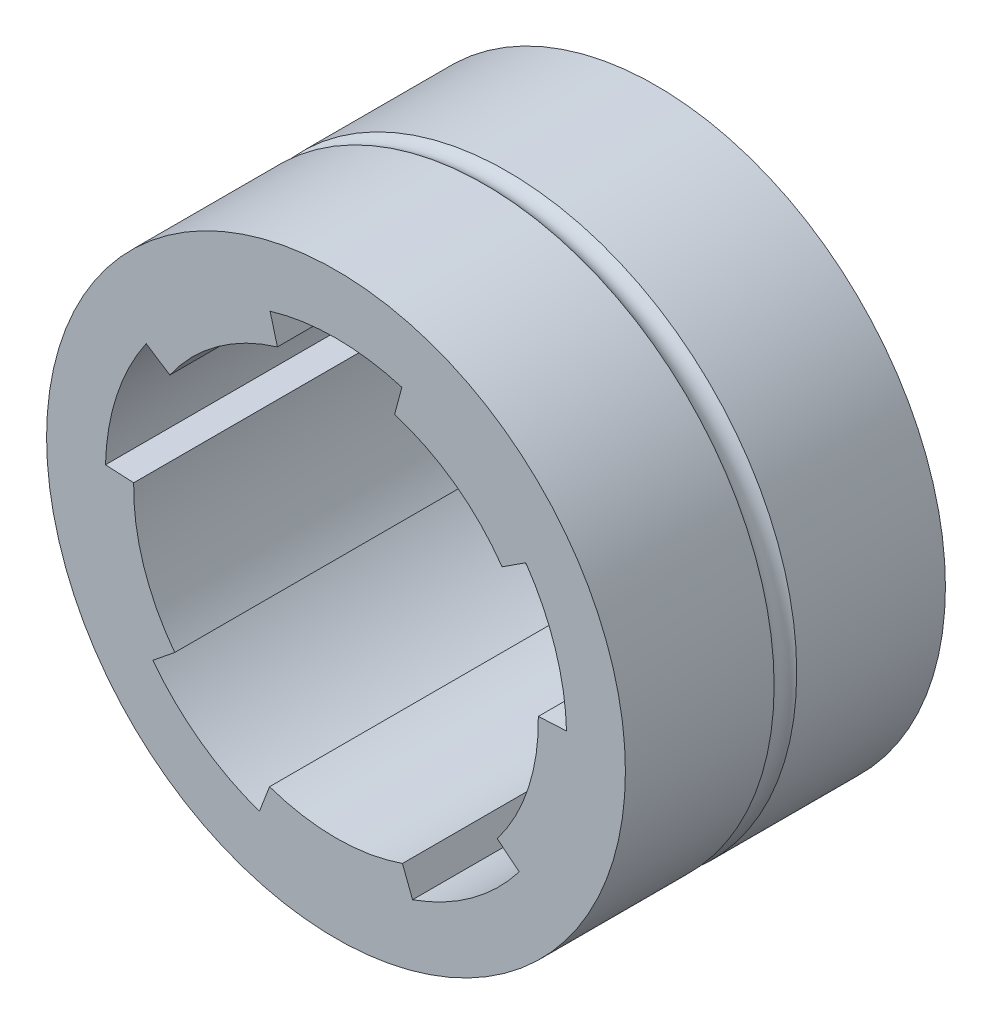
ISO-10303-21;
HEADER;
FILE_DESCRIPTION(('STEP AP214'),'2;1');
FILE_NAME('part.step','',(''),(''),'','','');
FILE_SCHEMA(('AUTOMOTIVE_DESIGN { 1 0 10303 214 1 1 1 1 }'));
ENDSEC;
DATA;
#1=APPLICATION_CONTEXT('core data for automotive mechanical design processes');
#2=APPLICATION_PROTOCOL_DEFINITION('international standard','automotive_design',2000,#1);
#3=PRODUCT_CONTEXT('',#1,'mechanical');
#4=PRODUCT('Part','Part','',(#3));
#5=PRODUCT_RELATED_PRODUCT_CATEGORY('part','',(#4));
#6=PRODUCT_DEFINITION_FORMATION('','',#4);
#7=PRODUCT_DEFINITION_CONTEXT('part definition',#1,'design');
#8=PRODUCT_DEFINITION('design','',#6,#7);
#9=PRODUCT_DEFINITION_SHAPE('','',#8);
#10=(LENGTH_UNIT() NAMED_UNIT(*) SI_UNIT(.MILLI.,.METRE.));
#11=(NAMED_UNIT(*) PLANE_ANGLE_UNIT() SI_UNIT($,.RADIAN.));
#12=(NAMED_UNIT(*) SI_UNIT($,.STERADIAN.) SOLID_ANGLE_UNIT());
#13=UNCERTAINTY_MEASURE_WITH_UNIT(LENGTH_MEASURE(1.E-05),#10,'distance_accuracy_value','');
#14=(GEOMETRIC_REPRESENTATION_CONTEXT(3) GLOBAL_UNCERTAINTY_ASSIGNED_CONTEXT((#13)) GLOBAL_UNIT_ASSIGNED_CONTEXT((#10,
#11,#12)) REPRESENTATION_CONTEXT('',''));
#15=CARTESIAN_POINT('',(0.,0.,0.));
#16=DIRECTION('',(0.,0.,1.));
#17=DIRECTION('',(1.,0.,0.));
#18=AXIS2_PLACEMENT_3D('',#15,#16,#17);
#19=CARTESIAN_POINT('',(0.,0.,-120.974134085945));
#20=DIRECTION('',(0.,0.,1.));
#21=DIRECTION('',(1.,0.,0.));
#22=AXIS2_PLACEMENT_3D('',#19,#20,#21);
#23=CYLINDRICAL_SURFACE('',#22,30.75);
#24=CARTESIAN_POINT('',(0.,0.,-15.8));
#25=DIRECTION('',(0.,0.,1.));
#26=DIRECTION('',(1.,0.,0.));
#27=AXIS2_PLACEMENT_3D('',#24,#25,#26);
#28=CIRCLE('',#27,30.75);
#29=CARTESIAN_POINT('',(30.75,0.,-15.8));
#30=VERTEX_POINT('',#29);
#31=EDGE_CURVE('E348',#30,#30,#28,.T.);
#32=ORIENTED_EDGE('',*,*,#31,.T.);
#33=EDGE_LOOP('',(#32));
#34=FACE_BOUND('',#33,.T.);
#35=CARTESIAN_POINT('',(0.,0.,0.));
#36=DIRECTION('',(0.,0.,1.));
#37=DIRECTION('',(1.,0.,0.));
#38=AXIS2_PLACEMENT_3D('',#35,#36,#37);
#39=CIRCLE('',#38,30.75);
#40=CARTESIAN_POINT('',(30.75,0.,0.));
#41=VERTEX_POINT('',#40);
#42=EDGE_CURVE('E277',#41,#41,#39,.T.);
#43=ORIENTED_EDGE('',*,*,#42,.F.);
#44=EDGE_LOOP('',(#43));
#45=FACE_BOUND('',#44,.T.);
#46=ADVANCED_FACE('F41',(#34,#45),#23,.T.);
#47=CARTESIAN_POINT('',(0.,0.,-18.2));
#48=DIRECTION('',(0.,0.,1.));
#49=DIRECTION('',(1.,0.,0.));
#50=AXIS2_PLACEMENT_3D('',#47,#48,#49);
#51=CIRCLE('',#50,30.75);
#52=CARTESIAN_POINT('',(30.75,0.,-18.2));
#53=VERTEX_POINT('',#52);
#54=EDGE_CURVE('E352',#53,#53,#51,.T.);
#55=ORIENTED_EDGE('',*,*,#54,.F.);
#56=EDGE_LOOP('',(#55));
#57=FACE_BOUND('',#56,.T.);
#58=CARTESIAN_POINT('',(0.,0.,-34.));
#59=DIRECTION('',(0.,0.,1.));
#60=DIRECTION('',(1.,0.,0.));
#61=AXIS2_PLACEMENT_3D('',#58,#59,#60);
#62=CIRCLE('',#61,30.75);
#63=CARTESIAN_POINT('',(30.75,0.,-34.));
#64=VERTEX_POINT('',#63);
#65=EDGE_CURVE('E11',#64,#64,#62,.F.);
#66=ORIENTED_EDGE('',*,*,#65,.F.);
#67=EDGE_LOOP('',(#66));
#68=FACE_BOUND('',#67,.T.);
#69=ADVANCED_FACE('F43',(#57,#68),#23,.T.);
#70=CARTESIAN_POINT('',(0.,0.,0.));
#71=DIRECTION('',(0.,0.,1.));
#72=DIRECTION('',(1.,0.,0.));
#73=AXIS2_PLACEMENT_3D('',#70,#71,#72);
#74=PLANE('',#73);
#75=CARTESIAN_POINT('',(0.,0.,0.));
#76=DIRECTION('',(0.,0.,1.));
#77=DIRECTION('',(1.,0.,0.));
#78=AXIS2_PLACEMENT_3D('',#75,#76,#77);
#79=CIRCLE('',#78,21.5);
#80=CARTESIAN_POINT('',(-6.22354286469245,20.579541156482,0.));
#81=VERTEX_POINT('',#80);
#82=CARTESIAN_POINT('',(-17.6491262088256,12.2783689496995,0.));
#83=VERTEX_POINT('',#82);
#84=EDGE_CURVE('E196',#81,#83,#79,.T.);
#85=ORIENTED_EDGE('',*,*,#84,.F.);
#86=DIRECTION('',(0.258819045102518,-0.965925826289069,0.));
#87=VECTOR('',#86,1.);
#88=CARTESIAN_POINT('',(-7.,23.4773186353492,0.));
#89=LINE('',#88,#87);
#90=CARTESIAN_POINT('',(-7.,23.4773186353492,0.));
#91=VERTEX_POINT('',#90);
#92=EDGE_CURVE('E270',#91,#81,#89,.T.);
#93=ORIENTED_EDGE('',*,*,#92,.F.);
#94=CARTESIAN_POINT('',(0.,0.,0.));
#95=DIRECTION('',(0.,0.,1.));
#96=DIRECTION('',(1.,0.,0.));
#97=AXIS2_PLACEMENT_3D('',#94,#95,#96);
#98=CIRCLE('',#97,24.4986630309842);
#99=CARTESIAN_POINT('',(7.,23.4773186353492,0.));
#100=VERTEX_POINT('',#99);
#101=EDGE_CURVE('E266',#100,#91,#98,.T.);
#102=ORIENTED_EDGE('',*,*,#101,.F.);
#103=DIRECTION('',(0.258819045102519,0.965925826289069,0.));
#104=VECTOR('',#103,1.);
#105=CARTESIAN_POINT('',(6.22354286469244,20.579541156482,0.));
#106=LINE('',#105,#104);
#107=CARTESIAN_POINT('',(6.22354286469244,20.579541156482,0.));
#108=VERTEX_POINT('',#107);
#109=EDGE_CURVE('E262',#108,#100,#106,.T.);
#110=ORIENTED_EDGE('',*,*,#109,.F.);
#111=CARTESIAN_POINT('',(0.,0.,0.));
#112=DIRECTION('',(0.,0.,1.));
#113=DIRECTION('',(1.,0.,0.));
#114=AXIS2_PLACEMENT_3D('',#111,#112,#113);
#115=CIRCLE('',#114,21.5);
#116=CARTESIAN_POINT('',(17.6491262088254,12.2783689496997,0.));
#117=VERTEX_POINT('',#116);
#118=EDGE_CURVE('E258',#117,#108,#115,.T.);
#119=ORIENTED_EDGE('',*,*,#118,.F.);
#120=DIRECTION('',(-0.83867056794542,-0.544639035015034,0.));
#121=VECTOR('',#120,1.);
#122=CARTESIAN_POINT('',(20.1651379126617,13.9122860547449,0.));
#123=LINE('',#122,#121);
#124=CARTESIAN_POINT('',(20.1651379126617,13.9122860547449,0.));
#125=VERTEX_POINT('',#124);
#126=EDGE_CURVE('E254',#125,#117,#123,.T.);
#127=ORIENTED_EDGE('',*,*,#126,.F.);
#128=CARTESIAN_POINT('',(0.,0.,0.));
#129=DIRECTION('',(0.,0.,1.));
#130=DIRECTION('',(1.,0.,0.));
#131=AXIS2_PLACEMENT_3D('',#128,#129,#130);
#132=CIRCLE('',#131,24.4986630309842);
#133=CARTESIAN_POINT('',(24.4913758339111,0.597494826612751,0.));
#134=VERTEX_POINT('',#133);
#135=EDGE_CURVE('E250',#134,#125,#132,.T.);
#136=ORIENTED_EDGE('',*,*,#135,.F.);
#137=DIRECTION('',(0.998629534754573,0.0523359562429588,0.));
#138=VECTOR('',#137,1.);
#139=CARTESIAN_POINT('',(21.4954872296474,0.440486957883874,0.));
#140=LINE('',#139,#138);
#141=CARTESIAN_POINT('',(21.4954872296474,0.440486957883874,0.));
#142=VERTEX_POINT('',#141);
#143=EDGE_CURVE('E246',#142,#134,#140,.T.);
#144=ORIENTED_EDGE('',*,*,#143,.F.);
#145=CARTESIAN_POINT('',(0.,0.,0.));
#146=DIRECTION('',(0.,0.,1.));
#147=DIRECTION('',(1.,0.,0.));
#148=AXIS2_PLACEMENT_3D('',#145,#146,#147);
#149=CIRCLE('',#148,21.5);
#150=CARTESIAN_POINT('',(17.1313027334833,-12.9910918191562,0.));
#151=VERTEX_POINT('',#150);
#152=EDGE_CURVE('E242',#151,#142,#149,.T.);
#153=ORIENTED_EDGE('',*,*,#152,.F.);
#154=DIRECTION('',(-0.777145961456976,0.629320391049832,0.));
#155=VECTOR('',#154,1.);
#156=CARTESIAN_POINT('',(19.4627406178543,-14.8790529923057,0.));
#157=LINE('',#156,#155);
#158=CARTESIAN_POINT('',(19.4627406178543,-14.8790529923057,0.));
#159=VERTEX_POINT('',#158);
#160=EDGE_CURVE('E238',#159,#151,#157,.T.);
#161=ORIENTED_EDGE('',*,*,#160,.F.);
#162=CARTESIAN_POINT('',(0.,0.,0.));
#163=DIRECTION('',(0.,0.,1.));
#164=DIRECTION('',(1.,0.,0.));
#165=AXIS2_PLACEMENT_3D('',#162,#163,#164);
#166=CIRCLE('',#165,24.4986630309843);
#167=CARTESIAN_POINT('',(8.13650269660507,-23.1080465244004,0.));
#168=VERTEX_POINT('',#167);
#169=EDGE_CURVE('E234',#168,#159,#166,.T.);
#170=ORIENTED_EDGE('',*,*,#169,.F.);
#171=DIRECTION('',(0.358367949545314,-0.933580426497197,0.));
#172=VECTOR('',#171,1.);
#173=CARTESIAN_POINT('',(7.06139884796913,-20.3073052449088,0.));
#174=LINE('',#173,#172);
#175=CARTESIAN_POINT('',(7.06139884796913,-20.3073052449088,0.));
#176=VERTEX_POINT('',#175);
#177=EDGE_CURVE('E230',#176,#168,#174,.T.);
#178=ORIENTED_EDGE('',*,*,#177,.F.);
#179=CARTESIAN_POINT('',(0.,0.,0.));
#180=DIRECTION('',(0.,0.,1.));
#181=DIRECTION('',(1.,0.,0.));
#182=AXIS2_PLACEMENT_3D('',#179,#180,#181);
#183=CIRCLE('',#182,21.5);
#184=CARTESIAN_POINT('',(-7.06139884796885,-20.3073052449089,0.));
#185=VERTEX_POINT('',#184);
#186=EDGE_CURVE('E226',#185,#176,#183,.T.);
#187=ORIENTED_EDGE('',*,*,#186,.F.);
#188=DIRECTION('',(0.3583679495453,0.933580426497202,0.));
#189=VECTOR('',#188,1.);
#190=CARTESIAN_POINT('',(-8.13650269660475,-23.1080465244005,0.));
#191=LINE('',#190,#189);
#192=CARTESIAN_POINT('',(-8.13650269660475,-23.1080465244005,0.));
#193=VERTEX_POINT('',#192);
#194=EDGE_CURVE('E222',#193,#185,#191,.T.);
#195=ORIENTED_EDGE('',*,*,#194,.F.);
#196=CARTESIAN_POINT('',(0.,0.,0.));
#197=DIRECTION('',(0.,0.,1.));
#198=DIRECTION('',(1.,0.,0.));
#199=AXIS2_PLACEMENT_3D('',#196,#197,#198);
#200=CIRCLE('',#199,24.4986630309842);
#201=CARTESIAN_POINT('',(-19.4627406178541,-14.8790529923059,0.));
#202=VERTEX_POINT('',#201);
#203=EDGE_CURVE('E218',#202,#193,#200,.T.);
#204=ORIENTED_EDGE('',*,*,#203,.F.);
#205=DIRECTION('',(-0.777145961456965,-0.629320391049845,0.));
#206=VECTOR('',#205,1.);
#207=CARTESIAN_POINT('',(-17.1313027334832,-12.9910918191564,0.));
#208=LINE('',#207,#206);
#209=CARTESIAN_POINT('',(-17.1313027334832,-12.9910918191564,0.));
#210=VERTEX_POINT('',#209);
#211=EDGE_CURVE('E214',#210,#202,#208,.T.);
#212=ORIENTED_EDGE('',*,*,#211,.F.);
#213=CARTESIAN_POINT('',(0.,0.,0.));
#214=DIRECTION('',(0.,0.,1.));
#215=DIRECTION('',(1.,0.,0.));
#216=AXIS2_PLACEMENT_3D('',#213,#214,#215);
#217=CIRCLE('',#216,21.5);
#218=CARTESIAN_POINT('',(-21.4954872296474,0.440486957883572,0.));
#219=VERTEX_POINT('',#218);
#220=EDGE_CURVE('E207',#219,#210,#217,.T.);
#221=ORIENTED_EDGE('',*,*,#220,.F.);
#222=DIRECTION('',(0.998629534754574,-0.0523359562429437,0.));
#223=VECTOR('',#222,1.);
#224=CARTESIAN_POINT('',(-24.4913758339111,0.597494826612404,0.));
#225=LINE('',#224,#223);
#226=CARTESIAN_POINT('',(-24.4913758339111,0.597494826612404,0.));
#227=VERTEX_POINT('',#226);
#228=EDGE_CURVE('E202',#227,#219,#225,.T.);
#229=ORIENTED_EDGE('',*,*,#228,.F.);
#230=CARTESIAN_POINT('',(0.,0.,0.));
#231=DIRECTION('',(0.,0.,1.));
#232=DIRECTION('',(1.,0.,0.));
#233=AXIS2_PLACEMENT_3D('',#230,#231,#232);
#234=CIRCLE('',#233,24.4986630309843);
#235=CARTESIAN_POINT('',(-20.1651379126619,13.9122860547446,0.));
#236=VERTEX_POINT('',#235);
#237=EDGE_CURVE('E181',#236,#227,#234,.T.);
#238=ORIENTED_EDGE('',*,*,#237,.F.);
#239=DIRECTION('',(-0.838670567945427,0.544639035015022,0.));
#240=VECTOR('',#239,1.);
#241=CARTESIAN_POINT('',(-17.6491262088256,12.2783689496995,0.));
#242=LINE('',#241,#240);
#243=EDGE_CURVE('E189',#83,#236,#242,.T.);
#244=ORIENTED_EDGE('',*,*,#243,.F.);
#245=EDGE_LOOP('',(#85,#93,#102,#110,#119,#127,#136,#144,#153,#161,#170,#178,#187,#195,#204,
#212,#221,#229,#238,#244));
#246=FACE_BOUND('',#245,.T.);
#247=ORIENTED_EDGE('',*,*,#42,.T.);
#248=EDGE_LOOP('',(#247));
#249=FACE_BOUND('',#248,.T.);
#250=ADVANCED_FACE('F198',(#246,#249),#74,.T.);
#251=CARTESIAN_POINT('',(-17.6491262088256,12.2783689496995,-120.974134085945));
#252=DIRECTION('',(0.544639035015022,0.838670567945427,0.));
#253=DIRECTION('',(-0.838670567945427,0.544639035015022,0.));
#254=AXIS2_PLACEMENT_3D('',#251,#252,#253);
#255=PLANE('',#254);
#256=DIRECTION('',(0.,0.,1.));
#257=VECTOR('',#256,1.);
#258=CARTESIAN_POINT('',(-20.1651379126619,13.9122860547446,-120.974134085945));
#259=LINE('',#258,#257);
#260=CARTESIAN_POINT('',(-20.1651379126619,13.9122860547446,-34.));
#261=VERTEX_POINT('',#260);
#262=EDGE_CURVE('E177',#261,#236,#259,.T.);
#263=ORIENTED_EDGE('',*,*,#262,.F.);
#264=DIRECTION('',(0.838670567945427,-0.544639035015022,0.));
#265=VECTOR('',#264,1.);
#266=CARTESIAN_POINT('',(-17.6491262088256,12.2783689496995,-34.));
#267=LINE('',#266,#265);
#268=CARTESIAN_POINT('',(-17.6491262088256,12.2783689496995,-34.));
#269=VERTEX_POINT('',#268);
#270=EDGE_CURVE('E45',#261,#269,#267,.T.);
#271=ORIENTED_EDGE('',*,*,#270,.T.);
#272=DIRECTION('',(0.,0.,1.));
#273=VECTOR('',#272,1.);
#274=CARTESIAN_POINT('',(-17.6491262088256,12.2783689496995,-120.974134085945));
#275=LINE('',#274,#273);
#276=EDGE_CURVE('E186',#269,#83,#275,.T.);
#277=ORIENTED_EDGE('',*,*,#276,.T.);
#278=ORIENTED_EDGE('',*,*,#243,.T.);
#279=EDGE_LOOP('',(#263,#271,#277,#278));
#280=FACE_BOUND('',#279,.T.);
#281=ADVANCED_FACE('F190',(#280),#255,.F.);
#282=CARTESIAN_POINT('',(0.,0.,-120.974134085945));
#283=DIRECTION('',(0.,0.,1.));
#284=DIRECTION('',(1.,0.,0.));
#285=AXIS2_PLACEMENT_3D('',#282,#283,#284);
#286=CYLINDRICAL_SURFACE('',#285,24.4986630309843);
#287=DIRECTION('',(0.,0.,1.));
#288=VECTOR('',#287,1.);
#289=CARTESIAN_POINT('',(-24.4913758339111,0.597494826612404,-120.974134085945));
#290=LINE('',#289,#288);
#291=CARTESIAN_POINT('',(-24.4913758339111,0.597494826612404,-34.));
#292=VERTEX_POINT('',#291);
#293=EDGE_CURVE('E185',#292,#227,#290,.T.);
#294=ORIENTED_EDGE('',*,*,#293,.F.);
#295=CARTESIAN_POINT('',(0.,0.,-34.));
#296=DIRECTION('',(0.,0.,1.));
#297=DIRECTION('',(1.,0.,0.));
#298=AXIS2_PLACEMENT_3D('',#295,#296,#297);
#299=CIRCLE('',#298,24.4986630309843);
#300=EDGE_CURVE('E51',#292,#261,#299,.F.);
#301=ORIENTED_EDGE('',*,*,#300,.T.);
#302=ORIENTED_EDGE('',*,*,#262,.T.);
#303=ORIENTED_EDGE('',*,*,#237,.T.);
#304=EDGE_LOOP('',(#294,#301,#302,#303));
#305=FACE_BOUND('',#304,.T.);
#306=ADVANCED_FACE('F179',(#305),#286,.F.);
#307=CARTESIAN_POINT('',(-24.4913758339111,0.597494826612404,-120.974134085945));
#308=DIRECTION('',(-0.0523359562429437,-0.998629534754574,0.));
#309=DIRECTION('',(0.998629534754574,-0.0523359562429437,0.));
#310=AXIS2_PLACEMENT_3D('',#307,#308,#309);
#311=PLANE('',#310);
#312=DIRECTION('',(0.,0.,1.));
#313=VECTOR('',#312,1.);
#314=CARTESIAN_POINT('',(-21.4954872296474,0.440486957883572,-120.974134085945));
#315=LINE('',#314,#313);
#316=CARTESIAN_POINT('',(-21.4954872296474,0.440486957883573,-34.));
#317=VERTEX_POINT('',#316);
#318=EDGE_CURVE('E323',#317,#219,#315,.T.);
#319=ORIENTED_EDGE('',*,*,#318,.F.);
#320=DIRECTION('',(-0.998629534754574,0.0523359562429437,0.));
#321=VECTOR('',#320,1.);
#322=CARTESIAN_POINT('',(-24.4913758339111,0.597494826612404,-34.));
#323=LINE('',#322,#321);
#324=EDGE_CURVE('E363',#317,#292,#323,.T.);
#325=ORIENTED_EDGE('',*,*,#324,.T.);
#326=ORIENTED_EDGE('',*,*,#293,.T.);
#327=ORIENTED_EDGE('',*,*,#228,.T.);
#328=EDGE_LOOP('',(#319,#325,#326,#327));
#329=FACE_BOUND('',#328,.T.);
#330=ADVANCED_FACE('F526',(#329),#311,.F.);
#331=CARTESIAN_POINT('',(0.,0.,-120.974134085945));
#332=DIRECTION('',(0.,0.,1.));
#333=DIRECTION('',(1.,0.,0.));
#334=AXIS2_PLACEMENT_3D('',#331,#332,#333);
#335=CYLINDRICAL_SURFACE('',#334,21.5);
#336=DIRECTION('',(0.,0.,1.));
#337=VECTOR('',#336,1.);
#338=CARTESIAN_POINT('',(-17.1313027334832,-12.9910918191564,-120.974134085945));
#339=LINE('',#338,#337);
#340=CARTESIAN_POINT('',(-17.1313027334832,-12.9910918191564,-34.));
#341=VERTEX_POINT('',#340);
#342=EDGE_CURVE('E320',#341,#210,#339,.T.);
#343=ORIENTED_EDGE('',*,*,#342,.F.);
#344=CARTESIAN_POINT('',(0.,0.,-34.));
#345=DIRECTION('',(0.,0.,1.));
#346=DIRECTION('',(1.,0.,0.));
#347=AXIS2_PLACEMENT_3D('',#344,#345,#346);
#348=CIRCLE('',#347,21.5);
#349=EDGE_CURVE('E367',#341,#317,#348,.F.);
#350=ORIENTED_EDGE('',*,*,#349,.T.);
#351=ORIENTED_EDGE('',*,*,#318,.T.);
#352=ORIENTED_EDGE('',*,*,#220,.T.);
#353=EDGE_LOOP('',(#343,#350,#351,#352));
#354=FACE_BOUND('',#353,.T.);
#355=ADVANCED_FACE('F522',(#354),#335,.F.);
#356=CARTESIAN_POINT('',(-17.1313027334832,-12.9910918191564,-120.974134085945));
#357=DIRECTION('',(-0.629320391049845,0.777145961456965,0.));
#358=DIRECTION('',(-0.777145961456965,-0.629320391049845,0.));
#359=AXIS2_PLACEMENT_3D('',#356,#357,#358);
#360=PLANE('',#359);
#361=DIRECTION('',(0.,0.,1.));
#362=VECTOR('',#361,1.);
#363=CARTESIAN_POINT('',(-19.4627406178541,-14.8790529923059,-120.974134085945));
#364=LINE('',#363,#362);
#365=CARTESIAN_POINT('',(-19.4627406178541,-14.8790529923059,-34.));
#366=VERTEX_POINT('',#365);
#367=EDGE_CURVE('E317',#366,#202,#364,.T.);
#368=ORIENTED_EDGE('',*,*,#367,.F.);
#369=DIRECTION('',(0.777145961456965,0.629320391049845,0.));
#370=VECTOR('',#369,1.);
#371=CARTESIAN_POINT('',(-17.1313027334832,-12.9910918191564,-34.));
#372=LINE('',#371,#370);
#373=EDGE_CURVE('E371',#366,#341,#372,.T.);
#374=ORIENTED_EDGE('',*,*,#373,.T.);
#375=ORIENTED_EDGE('',*,*,#342,.T.);
#376=ORIENTED_EDGE('',*,*,#211,.T.);
#377=EDGE_LOOP('',(#368,#374,#375,#376));
#378=FACE_BOUND('',#377,.T.);
#379=ADVANCED_FACE('F518',(#378),#360,.F.);
#380=CARTESIAN_POINT('',(0.,0.,-120.974134085945));
#381=DIRECTION('',(0.,0.,1.));
#382=DIRECTION('',(1.,0.,0.));
#383=AXIS2_PLACEMENT_3D('',#380,#381,#382);
#384=CYLINDRICAL_SURFACE('',#383,24.4986630309842);
#385=DIRECTION('',(0.,0.,1.));
#386=VECTOR('',#385,1.);
#387=CARTESIAN_POINT('',(-8.13650269660475,-23.1080465244005,-120.974134085945));
#388=LINE('',#387,#386);
#389=CARTESIAN_POINT('',(-8.13650269660475,-23.1080465244005,-34.));
#390=VERTEX_POINT('',#389);
#391=EDGE_CURVE('E314',#390,#193,#388,.T.);
#392=ORIENTED_EDGE('',*,*,#391,.F.);
#393=CARTESIAN_POINT('',(0.,0.,-34.));
#394=DIRECTION('',(0.,0.,1.));
#395=DIRECTION('',(1.,0.,0.));
#396=AXIS2_PLACEMENT_3D('',#393,#394,#395);
#397=CIRCLE('',#396,24.4986630309842);
#398=EDGE_CURVE('E375',#390,#366,#397,.F.);
#399=ORIENTED_EDGE('',*,*,#398,.T.);
#400=ORIENTED_EDGE('',*,*,#367,.T.);
#401=ORIENTED_EDGE('',*,*,#203,.T.);
#402=EDGE_LOOP('',(#392,#399,#400,#401));
#403=FACE_BOUND('',#402,.T.);
#404=ADVANCED_FACE('F514',(#403),#384,.F.);
#405=CARTESIAN_POINT('',(-8.13650269660475,-23.1080465244005,-120.974134085945));
#406=DIRECTION('',(0.933580426497202,-0.3583679495453,0.));
#407=DIRECTION('',(0.3583679495453,0.933580426497202,0.));
#408=AXIS2_PLACEMENT_3D('',#405,#406,#407);
#409=PLANE('',#408);
#410=DIRECTION('',(0.,0.,1.));
#411=VECTOR('',#410,1.);
#412=CARTESIAN_POINT('',(-7.06139884796885,-20.3073052449089,-120.974134085945));
#413=LINE('',#412,#411);
#414=CARTESIAN_POINT('',(-7.06139884796884,-20.3073052449089,-34.));
#415=VERTEX_POINT('',#414);
#416=EDGE_CURVE('E311',#415,#185,#413,.T.);
#417=ORIENTED_EDGE('',*,*,#416,.F.);
#418=DIRECTION('',(-0.3583679495453,-0.933580426497202,0.));
#419=VECTOR('',#418,1.);
#420=CARTESIAN_POINT('',(-8.13650269660475,-23.1080465244005,-34.));
#421=LINE('',#420,#419);
#422=EDGE_CURVE('E379',#415,#390,#421,.T.);
#423=ORIENTED_EDGE('',*,*,#422,.T.);
#424=ORIENTED_EDGE('',*,*,#391,.T.);
#425=ORIENTED_EDGE('',*,*,#194,.T.);
#426=EDGE_LOOP('',(#417,#423,#424,#425));
#427=FACE_BOUND('',#426,.T.);
#428=ADVANCED_FACE('F510',(#427),#409,.F.);
#429=CARTESIAN_POINT('',(0.,0.,-120.974134085945));
#430=DIRECTION('',(0.,0.,1.));
#431=DIRECTION('',(1.,0.,0.));
#432=AXIS2_PLACEMENT_3D('',#429,#430,#431);
#433=CYLINDRICAL_SURFACE('',#432,21.5);
#434=DIRECTION('',(0.,0.,1.));
#435=VECTOR('',#434,1.);
#436=CARTESIAN_POINT('',(7.06139884796913,-20.3073052449088,-120.974134085945));
#437=LINE('',#436,#435);
#438=CARTESIAN_POINT('',(7.06139884796913,-20.3073052449088,-34.));
#439=VERTEX_POINT('',#438);
#440=EDGE_CURVE('E308',#439,#176,#437,.T.);
#441=ORIENTED_EDGE('',*,*,#440,.F.);
#442=CARTESIAN_POINT('',(0.,0.,-34.));
#443=DIRECTION('',(0.,0.,1.));
#444=DIRECTION('',(1.,0.,0.));
#445=AXIS2_PLACEMENT_3D('',#442,#443,#444);
#446=CIRCLE('',#445,21.5);
#447=EDGE_CURVE('E383',#439,#415,#446,.F.);
#448=ORIENTED_EDGE('',*,*,#447,.T.);
#449=ORIENTED_EDGE('',*,*,#416,.T.);
#450=ORIENTED_EDGE('',*,*,#186,.T.);
#451=EDGE_LOOP('',(#441,#448,#449,#450));
#452=FACE_BOUND('',#451,.T.);
#453=ADVANCED_FACE('F506',(#452),#433,.F.);
#454=CARTESIAN_POINT('',(7.06139884796913,-20.3073052449088,-120.974134085945));
#455=DIRECTION('',(-0.933580426497197,-0.358367949545314,0.));
#456=DIRECTION('',(0.358367949545314,-0.933580426497197,0.));
#457=AXIS2_PLACEMENT_3D('',#454,#455,#456);
#458=PLANE('',#457);
#459=DIRECTION('',(0.,0.,1.));
#460=VECTOR('',#459,1.);
#461=CARTESIAN_POINT('',(8.13650269660507,-23.1080465244004,-120.974134085945));
#462=LINE('',#461,#460);
#463=CARTESIAN_POINT('',(8.13650269660508,-23.1080465244004,-34.));
#464=VERTEX_POINT('',#463);
#465=EDGE_CURVE('E305',#464,#168,#462,.T.);
#466=ORIENTED_EDGE('',*,*,#465,.F.);
#467=DIRECTION('',(-0.358367949545314,0.933580426497197,0.));
#468=VECTOR('',#467,1.);
#469=CARTESIAN_POINT('',(7.06139884796913,-20.3073052449088,-34.));
#470=LINE('',#469,#468);
#471=EDGE_CURVE('E387',#464,#439,#470,.T.);
#472=ORIENTED_EDGE('',*,*,#471,.T.);
#473=ORIENTED_EDGE('',*,*,#440,.T.);
#474=ORIENTED_EDGE('',*,*,#177,.T.);
#475=EDGE_LOOP('',(#466,#472,#473,#474));
#476=FACE_BOUND('',#475,.T.);
#477=ADVANCED_FACE('F502',(#476),#458,.F.);
#478=CARTESIAN_POINT('',(0.,0.,-120.974134085945));
#479=DIRECTION('',(0.,0.,1.));
#480=DIRECTION('',(1.,0.,0.));
#481=AXIS2_PLACEMENT_3D('',#478,#479,#480);
#482=CYLINDRICAL_SURFACE('',#481,24.4986630309843);
#483=DIRECTION('',(0.,0.,1.));
#484=VECTOR('',#483,1.);
#485=CARTESIAN_POINT('',(19.4627406178543,-14.8790529923057,-120.974134085945));
#486=LINE('',#485,#484);
#487=CARTESIAN_POINT('',(19.4627406178543,-14.8790529923057,-34.));
#488=VERTEX_POINT('',#487);
#489=EDGE_CURVE('E302',#488,#159,#486,.T.);
#490=ORIENTED_EDGE('',*,*,#489,.F.);
#491=CARTESIAN_POINT('',(0.,0.,-34.));
#492=DIRECTION('',(0.,0.,1.));
#493=DIRECTION('',(1.,0.,0.));
#494=AXIS2_PLACEMENT_3D('',#491,#492,#493);
#495=CIRCLE('',#494,24.4986630309843);
#496=EDGE_CURVE('E391',#488,#464,#495,.F.);
#497=ORIENTED_EDGE('',*,*,#496,.T.);
#498=ORIENTED_EDGE('',*,*,#465,.T.);
#499=ORIENTED_EDGE('',*,*,#169,.T.);
#500=EDGE_LOOP('',(#490,#497,#498,#499));
#501=FACE_BOUND('',#500,.T.);
#502=ADVANCED_FACE('F498',(#501),#482,.F.);
#503=CARTESIAN_POINT('',(19.4627406178543,-14.8790529923057,-120.974134085945));
#504=DIRECTION('',(0.629320391049832,0.777145961456976,0.));
#505=DIRECTION('',(-0.777145961456976,0.629320391049832,0.));
#506=AXIS2_PLACEMENT_3D('',#503,#504,#505);
#507=PLANE('',#506);
#508=DIRECTION('',(0.,0.,1.));
#509=VECTOR('',#508,1.);
#510=CARTESIAN_POINT('',(17.1313027334833,-12.9910918191562,-120.974134085945));
#511=LINE('',#510,#509);
#512=CARTESIAN_POINT('',(17.1313027334833,-12.9910918191562,-34.));
#513=VERTEX_POINT('',#512);
#514=EDGE_CURVE('E299',#513,#151,#511,.T.);
#515=ORIENTED_EDGE('',*,*,#514,.F.);
#516=DIRECTION('',(0.777145961456976,-0.629320391049832,0.));
#517=VECTOR('',#516,1.);
#518=CARTESIAN_POINT('',(19.4627406178543,-14.8790529923057,-34.));
#519=LINE('',#518,#517);
#520=EDGE_CURVE('E395',#513,#488,#519,.T.);
#521=ORIENTED_EDGE('',*,*,#520,.T.);
#522=ORIENTED_EDGE('',*,*,#489,.T.);
#523=ORIENTED_EDGE('',*,*,#160,.T.);
#524=EDGE_LOOP('',(#515,#521,#522,#523));
#525=FACE_BOUND('',#524,.T.);
#526=ADVANCED_FACE('F494',(#525),#507,.F.);
#527=CARTESIAN_POINT('',(0.,0.,-120.974134085945));
#528=DIRECTION('',(0.,0.,1.));
#529=DIRECTION('',(1.,0.,0.));
#530=AXIS2_PLACEMENT_3D('',#527,#528,#529);
#531=CYLINDRICAL_SURFACE('',#530,21.5);
#532=DIRECTION('',(0.,0.,1.));
#533=VECTOR('',#532,1.);
#534=CARTESIAN_POINT('',(21.4954872296474,0.440486957883874,-120.974134085945));
#535=LINE('',#534,#533);
#536=CARTESIAN_POINT('',(21.4954872296474,0.440486957883874,-34.));
#537=VERTEX_POINT('',#536);
#538=EDGE_CURVE('E296',#537,#142,#535,.T.);
#539=ORIENTED_EDGE('',*,*,#538,.F.);
#540=CARTESIAN_POINT('',(0.,0.,-34.));
#541=DIRECTION('',(0.,0.,1.));
#542=DIRECTION('',(1.,0.,0.));
#543=AXIS2_PLACEMENT_3D('',#540,#541,#542);
#544=CIRCLE('',#543,21.5);
#545=EDGE_CURVE('E399',#537,#513,#544,.F.);
#546=ORIENTED_EDGE('',*,*,#545,.T.);
#547=ORIENTED_EDGE('',*,*,#514,.T.);
#548=ORIENTED_EDGE('',*,*,#152,.T.);
#549=EDGE_LOOP('',(#539,#546,#547,#548));
#550=FACE_BOUND('',#549,.T.);
#551=ADVANCED_FACE('F490',(#550),#531,.F.);
#552=CARTESIAN_POINT('',(21.4954872296474,0.440486957883874,-120.974134085945));
#553=DIRECTION('',(0.0523359562429588,-0.998629534754573,0.));
#554=DIRECTION('',(0.998629534754573,0.0523359562429588,0.));
#555=AXIS2_PLACEMENT_3D('',#552,#553,#554);
#556=PLANE('',#555);
#557=DIRECTION('',(0.,0.,1.));
#558=VECTOR('',#557,1.);
#559=CARTESIAN_POINT('',(24.4913758339111,0.597494826612751,-120.974134085945));
#560=LINE('',#559,#558);
#561=CARTESIAN_POINT('',(24.4913758339111,0.597494826612751,-34.));
#562=VERTEX_POINT('',#561);
#563=EDGE_CURVE('E293',#562,#134,#560,.T.);
#564=ORIENTED_EDGE('',*,*,#563,.F.);
#565=DIRECTION('',(-0.998629534754573,-0.0523359562429588,0.));
#566=VECTOR('',#565,1.);
#567=CARTESIAN_POINT('',(21.4954872296474,0.440486957883874,-34.));
#568=LINE('',#567,#566);
#569=EDGE_CURVE('E403',#562,#537,#568,.T.);
#570=ORIENTED_EDGE('',*,*,#569,.T.);
#571=ORIENTED_EDGE('',*,*,#538,.T.);
#572=ORIENTED_EDGE('',*,*,#143,.T.);
#573=EDGE_LOOP('',(#564,#570,#571,#572));
#574=FACE_BOUND('',#573,.T.);
#575=ADVANCED_FACE('F486',(#574),#556,.F.);
#576=CARTESIAN_POINT('',(0.,0.,-120.974134085945));
#577=DIRECTION('',(0.,0.,1.));
#578=DIRECTION('',(1.,0.,0.));
#579=AXIS2_PLACEMENT_3D('',#576,#577,#578);
#580=CYLINDRICAL_SURFACE('',#579,24.4986630309842);
#581=DIRECTION('',(0.,0.,1.));
#582=VECTOR('',#581,1.);
#583=CARTESIAN_POINT('',(20.1651379126617,13.9122860547449,-120.974134085945));
#584=LINE('',#583,#582);
#585=CARTESIAN_POINT('',(20.1651379126617,13.9122860547449,-34.));
#586=VERTEX_POINT('',#585);
#587=EDGE_CURVE('E290',#586,#125,#584,.T.);
#588=ORIENTED_EDGE('',*,*,#587,.F.);
#589=CARTESIAN_POINT('',(0.,0.,-34.));
#590=DIRECTION('',(0.,0.,1.));
#591=DIRECTION('',(1.,0.,0.));
#592=AXIS2_PLACEMENT_3D('',#589,#590,#591);
#593=CIRCLE('',#592,24.4986630309842);
#594=EDGE_CURVE('E407',#586,#562,#593,.F.);
#595=ORIENTED_EDGE('',*,*,#594,.T.);
#596=ORIENTED_EDGE('',*,*,#563,.T.);
#597=ORIENTED_EDGE('',*,*,#135,.T.);
#598=EDGE_LOOP('',(#588,#595,#596,#597));
#599=FACE_BOUND('',#598,.T.);
#600=ADVANCED_FACE('F482',(#599),#580,.F.);
#601=CARTESIAN_POINT('',(20.1651379126617,13.9122860547449,-120.974134085945));
#602=DIRECTION('',(-0.544639035015034,0.83867056794542,0.));
#603=DIRECTION('',(-0.83867056794542,-0.544639035015034,0.));
#604=AXIS2_PLACEMENT_3D('',#601,#602,#603);
#605=PLANE('',#604);
#606=DIRECTION('',(0.,0.,1.));
#607=VECTOR('',#606,1.);
#608=CARTESIAN_POINT('',(17.6491262088254,12.2783689496997,-120.974134085945));
#609=LINE('',#608,#607);
#610=CARTESIAN_POINT('',(17.6491262088254,12.2783689496997,-34.));
#611=VERTEX_POINT('',#610);
#612=EDGE_CURVE('E287',#611,#117,#609,.T.);
#613=ORIENTED_EDGE('',*,*,#612,.F.);
#614=DIRECTION('',(0.83867056794542,0.544639035015034,0.));
#615=VECTOR('',#614,1.);
#616=CARTESIAN_POINT('',(20.1651379126617,13.9122860547449,-34.));
#617=LINE('',#616,#615);
#618=EDGE_CURVE('E411',#611,#586,#617,.T.);
#619=ORIENTED_EDGE('',*,*,#618,.T.);
#620=ORIENTED_EDGE('',*,*,#587,.T.);
#621=ORIENTED_EDGE('',*,*,#126,.T.);
#622=EDGE_LOOP('',(#613,#619,#620,#621));
#623=FACE_BOUND('',#622,.T.);
#624=ADVANCED_FACE('F478',(#623),#605,.F.);
#625=CARTESIAN_POINT('',(0.,0.,-120.974134085945));
#626=DIRECTION('',(0.,0.,1.));
#627=DIRECTION('',(1.,0.,0.));
#628=AXIS2_PLACEMENT_3D('',#625,#626,#627);
#629=CYLINDRICAL_SURFACE('',#628,21.5);
#630=DIRECTION('',(0.,0.,1.));
#631=VECTOR('',#630,1.);
#632=CARTESIAN_POINT('',(6.22354286469244,20.579541156482,-120.974134085945));
#633=LINE('',#632,#631);
#634=CARTESIAN_POINT('',(6.22354286469244,20.579541156482,-34.));
#635=VERTEX_POINT('',#634);
#636=EDGE_CURVE('E284',#635,#108,#633,.T.);
#637=ORIENTED_EDGE('',*,*,#636,.F.);
#638=CARTESIAN_POINT('',(0.,0.,-34.));
#639=DIRECTION('',(0.,0.,1.));
#640=DIRECTION('',(1.,0.,0.));
#641=AXIS2_PLACEMENT_3D('',#638,#639,#640);
#642=CIRCLE('',#641,21.5);
#643=EDGE_CURVE('E415',#635,#611,#642,.F.);
#644=ORIENTED_EDGE('',*,*,#643,.T.);
#645=ORIENTED_EDGE('',*,*,#612,.T.);
#646=ORIENTED_EDGE('',*,*,#118,.T.);
#647=EDGE_LOOP('',(#637,#644,#645,#646));
#648=FACE_BOUND('',#647,.T.);
#649=ADVANCED_FACE('F475',(#648),#629,.F.);
#650=CARTESIAN_POINT('',(6.22354286469244,20.579541156482,-120.974134085945));
#651=DIRECTION('',(0.965925826289069,-0.258819045102519,0.));
#652=DIRECTION('',(0.258819045102519,0.965925826289069,0.));
#653=AXIS2_PLACEMENT_3D('',#650,#651,#652);
#654=PLANE('',#653);
#655=DIRECTION('',(0.,0.,1.));
#656=VECTOR('',#655,1.);
#657=CARTESIAN_POINT('',(7.,23.4773186353492,-120.974134085945));
#658=LINE('',#657,#656);
#659=CARTESIAN_POINT('',(7.,23.4773186353492,-34.));
#660=VERTEX_POINT('',#659);
#661=EDGE_CURVE('E281',#660,#100,#658,.T.);
#662=ORIENTED_EDGE('',*,*,#661,.F.);
#663=DIRECTION('',(-0.258819045102519,-0.965925826289069,0.));
#664=VECTOR('',#663,1.);
#665=CARTESIAN_POINT('',(6.22354286469244,20.579541156482,-34.));
#666=LINE('',#665,#664);
#667=EDGE_CURVE('E419',#660,#635,#666,.T.);
#668=ORIENTED_EDGE('',*,*,#667,.T.);
#669=ORIENTED_EDGE('',*,*,#636,.T.);
#670=ORIENTED_EDGE('',*,*,#109,.T.);
#671=EDGE_LOOP('',(#662,#668,#669,#670));
#672=FACE_BOUND('',#671,.T.);
#673=ADVANCED_FACE('F433',(#672),#654,.F.);
#674=CARTESIAN_POINT('',(0.,0.,-120.974134085945));
#675=DIRECTION('',(0.,0.,1.));
#676=DIRECTION('',(1.,0.,0.));
#677=AXIS2_PLACEMENT_3D('',#674,#675,#676);
#678=CYLINDRICAL_SURFACE('',#677,24.4986630309842);
#679=DIRECTION('',(0.,0.,1.));
#680=VECTOR('',#679,1.);
#681=CARTESIAN_POINT('',(-7.,23.4773186353492,-120.974134085945));
#682=LINE('',#681,#680);
#683=CARTESIAN_POINT('',(-7.,23.4773186353492,-34.));
#684=VERTEX_POINT('',#683);
#685=EDGE_CURVE('E278',#684,#91,#682,.T.);
#686=ORIENTED_EDGE('',*,*,#685,.F.);
#687=CARTESIAN_POINT('',(0.,0.,-34.));
#688=DIRECTION('',(0.,0.,1.));
#689=DIRECTION('',(1.,0.,0.));
#690=AXIS2_PLACEMENT_3D('',#687,#688,#689);
#691=CIRCLE('',#690,24.4986630309842);
#692=EDGE_CURVE('E344',#684,#660,#691,.F.);
#693=ORIENTED_EDGE('',*,*,#692,.T.);
#694=ORIENTED_EDGE('',*,*,#661,.T.);
#695=ORIENTED_EDGE('',*,*,#101,.T.);
#696=EDGE_LOOP('',(#686,#693,#694,#695));
#697=FACE_BOUND('',#696,.T.);
#698=ADVANCED_FACE('F427',(#697),#678,.F.);
#699=CARTESIAN_POINT('',(-7.,23.4773186353492,-120.974134085945));
#700=DIRECTION('',(-0.965925826289069,-0.258819045102518,0.));
#701=DIRECTION('',(0.258819045102518,-0.965925826289069,0.));
#702=AXIS2_PLACEMENT_3D('',#699,#700,#701);
#703=PLANE('',#702);
#704=DIRECTION('',(0.,0.,1.));
#705=VECTOR('',#704,1.);
#706=CARTESIAN_POINT('',(-6.22354286469245,20.579541156482,-120.974134085945));
#707=LINE('',#706,#705);
#708=CARTESIAN_POINT('',(-6.22354286469245,20.579541156482,-34.));
#709=VERTEX_POINT('',#708);
#710=EDGE_CURVE('E274',#709,#81,#707,.T.);
#711=ORIENTED_EDGE('',*,*,#710,.F.);
#712=DIRECTION('',(-0.258819045102518,0.965925826289069,0.));
#713=VECTOR('',#712,1.);
#714=CARTESIAN_POINT('',(-7.,23.4773186353492,-34.));
#715=LINE('',#714,#713);
#716=EDGE_CURVE('E338',#709,#684,#715,.T.);
#717=ORIENTED_EDGE('',*,*,#716,.T.);
#718=ORIENTED_EDGE('',*,*,#685,.T.);
#719=ORIENTED_EDGE('',*,*,#92,.T.);
#720=EDGE_LOOP('',(#711,#717,#718,#719));
#721=FACE_BOUND('',#720,.T.);
#722=ADVANCED_FACE('F439',(#721),#703,.F.);
#723=CARTESIAN_POINT('',(0.,0.,-120.974134085945));
#724=DIRECTION('',(0.,0.,1.));
#725=DIRECTION('',(1.,0.,0.));
#726=AXIS2_PLACEMENT_3D('',#723,#724,#725);
#727=CYLINDRICAL_SURFACE('',#726,21.5);
#728=ORIENTED_EDGE('',*,*,#276,.F.);
#729=CARTESIAN_POINT('',(0.,0.,-34.));
#730=DIRECTION('',(0.,0.,1.));
#731=DIRECTION('',(1.,0.,0.));
#732=AXIS2_PLACEMENT_3D('',#729,#730,#731);
#733=CIRCLE('',#732,21.5);
#734=EDGE_CURVE('E334',#269,#709,#733,.F.);
#735=ORIENTED_EDGE('',*,*,#734,.T.);
#736=ORIENTED_EDGE('',*,*,#710,.T.);
#737=ORIENTED_EDGE('',*,*,#84,.T.);
#738=EDGE_LOOP('',(#728,#735,#736,#737));
#739=FACE_BOUND('',#738,.T.);
#740=ADVANCED_FACE('F440',(#739),#727,.F.);
#741=CARTESIAN_POINT('',(0.,0.,-34.));
#742=DIRECTION('',(0.,0.,1.));
#743=DIRECTION('',(1.,0.,0.));
#744=AXIS2_PLACEMENT_3D('',#741,#742,#743);
#745=PLANE('',#744);
#746=ORIENTED_EDGE('',*,*,#65,.T.);
#747=EDGE_LOOP('',(#746));
#748=FACE_BOUND('',#747,.T.);
#749=ORIENTED_EDGE('',*,*,#270,.F.);
#750=ORIENTED_EDGE('',*,*,#300,.F.);
#751=ORIENTED_EDGE('',*,*,#324,.F.);
#752=ORIENTED_EDGE('',*,*,#349,.F.);
#753=ORIENTED_EDGE('',*,*,#373,.F.);
#754=ORIENTED_EDGE('',*,*,#398,.F.);
#755=ORIENTED_EDGE('',*,*,#422,.F.);
#756=ORIENTED_EDGE('',*,*,#447,.F.);
#757=ORIENTED_EDGE('',*,*,#471,.F.);
#758=ORIENTED_EDGE('',*,*,#496,.F.);
#759=ORIENTED_EDGE('',*,*,#520,.F.);
#760=ORIENTED_EDGE('',*,*,#545,.F.);
#761=ORIENTED_EDGE('',*,*,#569,.F.);
#762=ORIENTED_EDGE('',*,*,#594,.F.);
#763=ORIENTED_EDGE('',*,*,#618,.F.);
#764=ORIENTED_EDGE('',*,*,#643,.F.);
#765=ORIENTED_EDGE('',*,*,#667,.F.);
#766=ORIENTED_EDGE('',*,*,#692,.F.);
#767=ORIENTED_EDGE('',*,*,#716,.F.);
#768=ORIENTED_EDGE('',*,*,#734,.F.);
#769=EDGE_LOOP('',(#749,#750,#751,#752,#753,#754,#755,#756,#757,#758,#759,#760,#761,#762,#763,
#764,#765,#766,#767,#768));
#770=FACE_BOUND('',#769,.T.);
#771=ADVANCED_FACE('F429',(#748,#770),#745,.F.);
#772=CARTESIAN_POINT('',(0.,0.,-17.));
#773=DIRECTION('',(0.,0.,1.));
#774=DIRECTION('',(1.,0.,0.));
#775=AXIS2_PLACEMENT_3D('',#772,#773,#774);
#776=TOROIDAL_SURFACE('',#775,31.94,1.69);
#777=ORIENTED_EDGE('',*,*,#31,.F.);
#778=EDGE_LOOP('',(#777));
#779=FACE_BOUND('',#778,.T.);
#780=ORIENTED_EDGE('',*,*,#54,.T.);
#781=EDGE_LOOP('',(#780));
#782=FACE_BOUND('',#781,.T.);
#783=ADVANCED_FACE('F447',(#779,#782),#776,.F.);
#784=CLOSED_SHELL('',(#46,#69,#250,#281,#306,#330,#355,#379,#404,#428,#453,#477,#502,#526,#551,
#575,#600,#624,#649,#673,#698,#722,#740,#771,#783));
#785=MANIFOLD_SOLID_BREP('B2',#784);
#786=ADVANCED_BREP_SHAPE_REPRESENTATION('',(#18,#785),#14);
#787=SHAPE_DEFINITION_REPRESENTATION(#9,#786);
ENDSEC;
END-ISO-10303-21;
